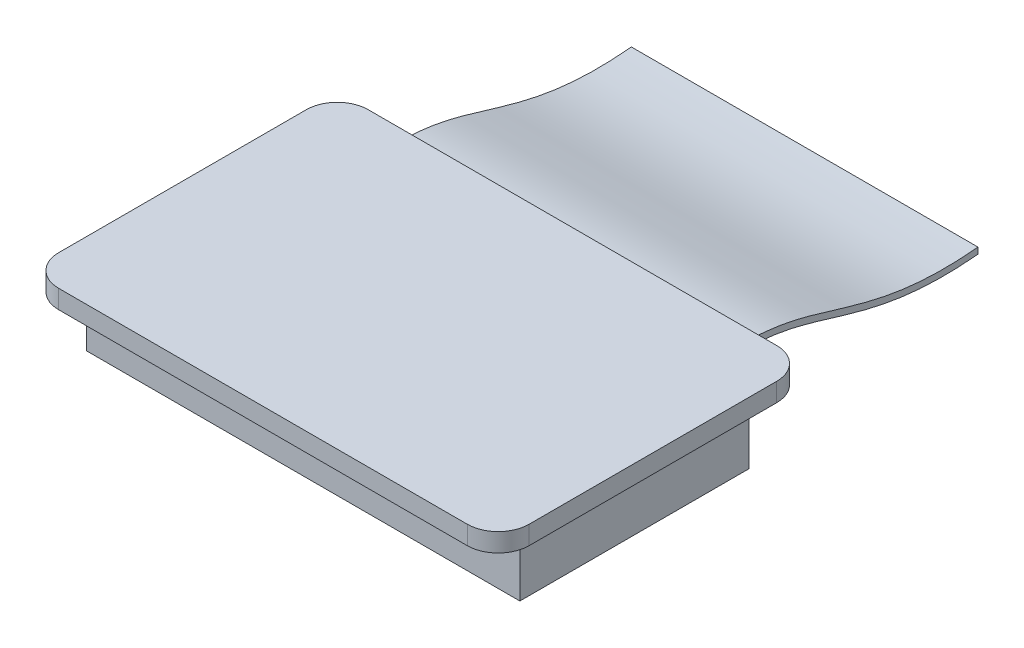
ISO-10303-21;
HEADER;
FILE_DESCRIPTION(('STEP AP214'),'2;1');
FILE_NAME('part.step','',(''),(''),'','','');
FILE_SCHEMA(('AUTOMOTIVE_DESIGN { 1 0 10303 214 1 1 1 1 }'));
ENDSEC;
DATA;
#1=APPLICATION_CONTEXT('core data for automotive mechanical design processes');
#2=APPLICATION_PROTOCOL_DEFINITION('international standard','automotive_design',2000,#1);
#3=PRODUCT_CONTEXT('',#1,'mechanical');
#4=PRODUCT('Part','Part','',(#3));
#5=PRODUCT_RELATED_PRODUCT_CATEGORY('part','',(#4));
#6=PRODUCT_DEFINITION_FORMATION('','',#4);
#7=PRODUCT_DEFINITION_CONTEXT('part definition',#1,'design');
#8=PRODUCT_DEFINITION('design','',#6,#7);
#9=PRODUCT_DEFINITION_SHAPE('','',#8);
#10=(LENGTH_UNIT() NAMED_UNIT(*) SI_UNIT(.MILLI.,.METRE.));
#11=(NAMED_UNIT(*) PLANE_ANGLE_UNIT() SI_UNIT($,.RADIAN.));
#12=(NAMED_UNIT(*) SI_UNIT($,.STERADIAN.) SOLID_ANGLE_UNIT());
#13=UNCERTAINTY_MEASURE_WITH_UNIT(LENGTH_MEASURE(1.E-05),#10,'distance_accuracy_value','');
#14=(GEOMETRIC_REPRESENTATION_CONTEXT(3) GLOBAL_UNCERTAINTY_ASSIGNED_CONTEXT((#13)) GLOBAL_UNIT_ASSIGNED_CONTEXT((#10,
#11,#12)) REPRESENTATION_CONTEXT('',''));
#15=CARTESIAN_POINT('',(0.,0.,0.));
#16=DIRECTION('',(0.,0.,1.));
#17=DIRECTION('',(1.,0.,0.));
#18=AXIS2_PLACEMENT_3D('',#15,#16,#17);
#19=CARTESIAN_POINT('',(3.3,0.748301222298696,8.25169585037883));
#20=DIRECTION('',(0.,-1.,0.));
#21=DIRECTION('',(0.,0.,-1.));
#22=AXIS2_PLACEMENT_3D('',#19,#20,#21);
#23=CYLINDRICAL_SURFACE('',#22,0.5);
#24=CARTESIAN_POINT('',(3.3,0.448301222298696,8.25169585037883));
#25=DIRECTION('',(0.,-1.,0.));
#26=DIRECTION('',(0.,0.,-1.));
#27=AXIS2_PLACEMENT_3D('',#24,#25,#26);
#28=CIRCLE('',#27,0.5);
#29=CARTESIAN_POINT('',(3.3,0.448301222298696,7.75169585037883));
#30=VERTEX_POINT('',#29);
#31=CARTESIAN_POINT('',(3.8,0.448301222298696,8.25169585037883));
#32=VERTEX_POINT('',#31);
#33=EDGE_CURVE('E177',#30,#32,#28,.T.);
#34=ORIENTED_EDGE('',*,*,#33,.F.);
#35=DIRECTION('',(0.,-1.,0.));
#36=VECTOR('',#35,1.);
#37=CARTESIAN_POINT('',(3.3,0.748301222298696,7.75169585037883));
#38=LINE('',#37,#36);
#39=CARTESIAN_POINT('',(3.3,0.748301222298696,7.75169585037883));
#40=VERTEX_POINT('',#39);
#41=EDGE_CURVE('E13',#40,#30,#38,.T.);
#42=ORIENTED_EDGE('',*,*,#41,.F.);
#43=CARTESIAN_POINT('',(3.3,0.748301222298696,8.25169585037883));
#44=DIRECTION('',(0.,-1.,0.));
#45=DIRECTION('',(0.,0.,-1.));
#46=AXIS2_PLACEMENT_3D('',#43,#44,#45);
#47=CIRCLE('',#46,0.5);
#48=CARTESIAN_POINT('',(3.8,0.748301222298696,8.25169585037883));
#49=VERTEX_POINT('',#48);
#50=EDGE_CURVE('E198',#40,#49,#47,.T.);
#51=ORIENTED_EDGE('',*,*,#50,.T.);
#52=DIRECTION('',(0.,-1.,0.));
#53=VECTOR('',#52,1.);
#54=CARTESIAN_POINT('',(3.8,0.748301222298696,8.25169585037883));
#55=LINE('',#54,#53);
#56=EDGE_CURVE('E70',#49,#32,#55,.T.);
#57=ORIENTED_EDGE('',*,*,#56,.T.);
#58=EDGE_LOOP('',(#34,#42,#51,#57));
#59=FACE_BOUND('',#58,.T.);
#60=ADVANCED_FACE('F67',(#59),#23,.T.);
#61=CARTESIAN_POINT('',(-3.3,0.748301222298696,7.75169585037883));
#62=DIRECTION('',(0.,0.,-1.));
#63=DIRECTION('',(-1.,0.,0.));
#64=AXIS2_PLACEMENT_3D('',#61,#62,#63);
#65=PLANE('',#64);
#66=DIRECTION('',(1.,0.,0.));
#67=VECTOR('',#66,1.);
#68=CARTESIAN_POINT('',(-3.3,0.448301222298696,7.75169585037883));
#69=LINE('',#68,#67);
#70=CARTESIAN_POINT('',(-3.3,0.448301222298696,7.75169585037883));
#71=VERTEX_POINT('',#70);
#72=EDGE_CURVE('E196',#71,#30,#69,.T.);
#73=ORIENTED_EDGE('',*,*,#72,.F.);
#74=DIRECTION('',(0.,-1.,0.));
#75=VECTOR('',#74,1.);
#76=CARTESIAN_POINT('',(-3.3,0.748301222298696,7.75169585037883));
#77=LINE('',#76,#75);
#78=CARTESIAN_POINT('',(-3.3,0.748301222298696,7.75169585037883));
#79=VERTEX_POINT('',#78);
#80=EDGE_CURVE('E75',#79,#71,#77,.T.);
#81=ORIENTED_EDGE('',*,*,#80,.F.);
#82=DIRECTION('',(1.,0.,0.));
#83=VECTOR('',#82,1.);
#84=CARTESIAN_POINT('',(-3.3,0.748301222298696,7.75169585037883));
#85=LINE('',#84,#83);
#86=EDGE_CURVE('E167',#79,#40,#85,.T.);
#87=ORIENTED_EDGE('',*,*,#86,.T.);
#88=ORIENTED_EDGE('',*,*,#41,.T.);
#89=EDGE_LOOP('',(#73,#81,#87,#88));
#90=FACE_BOUND('',#89,.T.);
#91=ADVANCED_FACE('F210',(#90),#65,.T.);
#92=CARTESIAN_POINT('',(-3.3,0.748301222298696,8.25169585037883));
#93=DIRECTION('',(0.,-1.,0.));
#94=DIRECTION('',(0.,0.,-1.));
#95=AXIS2_PLACEMENT_3D('',#92,#93,#94);
#96=CYLINDRICAL_SURFACE('',#95,0.5);
#97=CARTESIAN_POINT('',(-3.3,0.448301222298696,8.25169585037883));
#98=DIRECTION('',(0.,-1.,0.));
#99=DIRECTION('',(0.,0.,-1.));
#100=AXIS2_PLACEMENT_3D('',#97,#98,#99);
#101=CIRCLE('',#100,0.5);
#102=CARTESIAN_POINT('',(-3.8,0.448301222298696,8.25169585037883));
#103=VERTEX_POINT('',#102);
#104=EDGE_CURVE('E154',#103,#71,#101,.T.);
#105=ORIENTED_EDGE('',*,*,#104,.F.);
#106=DIRECTION('',(0.,-1.,0.));
#107=VECTOR('',#106,1.);
#108=CARTESIAN_POINT('',(-3.8,0.748301222298696,8.25169585037883));
#109=LINE('',#108,#107);
#110=CARTESIAN_POINT('',(-3.8,0.748301222298696,8.25169585037883));
#111=VERTEX_POINT('',#110);
#112=EDGE_CURVE('E148',#111,#103,#109,.T.);
#113=ORIENTED_EDGE('',*,*,#112,.F.);
#114=CARTESIAN_POINT('',(-3.3,0.748301222298696,8.25169585037883));
#115=DIRECTION('',(0.,-1.,0.));
#116=DIRECTION('',(0.,0.,-1.));
#117=AXIS2_PLACEMENT_3D('',#114,#115,#116);
#118=CIRCLE('',#117,0.5);
#119=EDGE_CURVE('E151',#111,#79,#118,.T.);
#120=ORIENTED_EDGE('',*,*,#119,.T.);
#121=ORIENTED_EDGE('',*,*,#80,.T.);
#122=EDGE_LOOP('',(#105,#113,#120,#121));
#123=FACE_BOUND('',#122,.T.);
#124=ADVANCED_FACE('F150',(#123),#96,.T.);
#125=CARTESIAN_POINT('',(-3.8,0.748301222298696,12.2516958503788));
#126=DIRECTION('',(-1.,0.,0.));
#127=DIRECTION('',(0.,0.,1.));
#128=AXIS2_PLACEMENT_3D('',#125,#126,#127);
#129=PLANE('',#128);
#130=DIRECTION('',(0.,0.,-1.));
#131=VECTOR('',#130,1.);
#132=CARTESIAN_POINT('',(-3.8,0.448301222298696,12.2516958503788));
#133=LINE('',#132,#131);
#134=CARTESIAN_POINT('',(-3.8,0.448301222298696,12.2516958503788));
#135=VERTEX_POINT('',#134);
#136=EDGE_CURVE('E193',#135,#103,#133,.T.);
#137=ORIENTED_EDGE('',*,*,#136,.F.);
#138=DIRECTION('',(0.,-1.,0.));
#139=VECTOR('',#138,1.);
#140=CARTESIAN_POINT('',(-3.8,0.748301222298696,12.2516958503788));
#141=LINE('',#140,#139);
#142=CARTESIAN_POINT('',(-3.8,0.748301222298696,12.2516958503788));
#143=VERTEX_POINT('',#142);
#144=EDGE_CURVE('E159',#143,#135,#141,.T.);
#145=ORIENTED_EDGE('',*,*,#144,.F.);
#146=DIRECTION('',(0.,0.,-1.));
#147=VECTOR('',#146,1.);
#148=CARTESIAN_POINT('',(-3.8,0.748301222298696,12.2516958503788));
#149=LINE('',#148,#147);
#150=EDGE_CURVE('E165',#143,#111,#149,.T.);
#151=ORIENTED_EDGE('',*,*,#150,.T.);
#152=ORIENTED_EDGE('',*,*,#112,.T.);
#153=EDGE_LOOP('',(#137,#145,#151,#152));
#154=FACE_BOUND('',#153,.T.);
#155=ADVANCED_FACE('F169',(#154),#129,.T.);
#156=CARTESIAN_POINT('',(-3.3,0.748301222298696,12.2516958503788));
#157=DIRECTION('',(0.,-1.,0.));
#158=DIRECTION('',(0.,0.,-1.));
#159=AXIS2_PLACEMENT_3D('',#156,#157,#158);
#160=CYLINDRICAL_SURFACE('',#159,0.5);
#161=CARTESIAN_POINT('',(-3.3,0.448301222298696,12.2516958503788));
#162=DIRECTION('',(0.,-1.,0.));
#163=DIRECTION('',(0.,0.,-1.));
#164=AXIS2_PLACEMENT_3D('',#161,#162,#163);
#165=CIRCLE('',#164,0.5);
#166=CARTESIAN_POINT('',(-3.3,0.448301222298696,12.7516958503788));
#167=VERTEX_POINT('',#166);
#168=EDGE_CURVE('E190',#167,#135,#165,.T.);
#169=ORIENTED_EDGE('',*,*,#168,.F.);
#170=DIRECTION('',(0.,-1.,0.));
#171=VECTOR('',#170,1.);
#172=CARTESIAN_POINT('',(-3.3,0.748301222298696,12.7516958503788));
#173=LINE('',#172,#171);
#174=CARTESIAN_POINT('',(-3.3,0.748301222298696,12.7516958503788));
#175=VERTEX_POINT('',#174);
#176=EDGE_CURVE('E202',#175,#167,#173,.T.);
#177=ORIENTED_EDGE('',*,*,#176,.F.);
#178=CARTESIAN_POINT('',(-3.3,0.748301222298696,12.2516958503788));
#179=DIRECTION('',(0.,-1.,0.));
#180=DIRECTION('',(0.,0.,-1.));
#181=AXIS2_PLACEMENT_3D('',#178,#179,#180);
#182=CIRCLE('',#181,0.5);
#183=EDGE_CURVE('E170',#175,#143,#182,.T.);
#184=ORIENTED_EDGE('',*,*,#183,.T.);
#185=ORIENTED_EDGE('',*,*,#144,.T.);
#186=EDGE_LOOP('',(#169,#177,#184,#185));
#187=FACE_BOUND('',#186,.T.);
#188=ADVANCED_FACE('F223',(#187),#160,.T.);
#189=CARTESIAN_POINT('',(-3.3,0.748301222298696,12.7516958503788));
#190=DIRECTION('',(0.,0.,1.));
#191=DIRECTION('',(1.,0.,0.));
#192=AXIS2_PLACEMENT_3D('',#189,#190,#191);
#193=PLANE('',#192);
#194=DIRECTION('',(-1.,0.,0.));
#195=VECTOR('',#194,1.);
#196=CARTESIAN_POINT('',(-3.3,0.448301222298696,12.7516958503788));
#197=LINE('',#196,#195);
#198=CARTESIAN_POINT('',(3.3,0.448301222298696,12.7516958503788));
#199=VERTEX_POINT('',#198);
#200=EDGE_CURVE('E187',#199,#167,#197,.T.);
#201=ORIENTED_EDGE('',*,*,#200,.F.);
#202=DIRECTION('',(0.,-1.,0.));
#203=VECTOR('',#202,1.);
#204=CARTESIAN_POINT('',(3.3,0.748301222298696,12.7516958503788));
#205=LINE('',#204,#203);
#206=CARTESIAN_POINT('',(3.3,0.748301222298696,12.7516958503788));
#207=VERTEX_POINT('',#206);
#208=EDGE_CURVE('E204',#207,#199,#205,.T.);
#209=ORIENTED_EDGE('',*,*,#208,.F.);
#210=DIRECTION('',(-1.,0.,0.));
#211=VECTOR('',#210,1.);
#212=CARTESIAN_POINT('',(-3.3,0.748301222298696,12.7516958503788));
#213=LINE('',#212,#211);
#214=EDGE_CURVE('E172',#207,#175,#213,.T.);
#215=ORIENTED_EDGE('',*,*,#214,.T.);
#216=ORIENTED_EDGE('',*,*,#176,.T.);
#217=EDGE_LOOP('',(#201,#209,#215,#216));
#218=FACE_BOUND('',#217,.T.);
#219=ADVANCED_FACE('F226',(#218),#193,.T.);
#220=CARTESIAN_POINT('',(3.3,0.748301222298696,12.2516958503788));
#221=DIRECTION('',(0.,-1.,0.));
#222=DIRECTION('',(0.,0.,-1.));
#223=AXIS2_PLACEMENT_3D('',#220,#221,#222);
#224=CYLINDRICAL_SURFACE('',#223,0.5);
#225=CARTESIAN_POINT('',(3.3,0.448301222298696,12.2516958503788));
#226=DIRECTION('',(0.,-1.,0.));
#227=DIRECTION('',(0.,0.,1.));
#228=AXIS2_PLACEMENT_3D('',#225,#226,#227);
#229=CIRCLE('',#228,0.5);
#230=CARTESIAN_POINT('',(3.8,0.448301222298696,12.2516958503788));
#231=VERTEX_POINT('',#230);
#232=EDGE_CURVE('E184',#231,#199,#229,.T.);
#233=ORIENTED_EDGE('',*,*,#232,.F.);
#234=DIRECTION('',(0.,-1.,0.));
#235=VECTOR('',#234,1.);
#236=CARTESIAN_POINT('',(3.8,0.748301222298696,12.2516958503788));
#237=LINE('',#236,#235);
#238=CARTESIAN_POINT('',(3.8,0.748301222298696,12.2516958503788));
#239=VERTEX_POINT('',#238);
#240=EDGE_CURVE('E205',#239,#231,#237,.T.);
#241=ORIENTED_EDGE('',*,*,#240,.F.);
#242=CARTESIAN_POINT('',(3.3,0.748301222298696,12.2516958503788));
#243=DIRECTION('',(0.,-1.,0.));
#244=DIRECTION('',(0.,0.,1.));
#245=AXIS2_PLACEMENT_3D('',#242,#243,#244);
#246=CIRCLE('',#245,0.5);
#247=EDGE_CURVE('E294',#239,#207,#246,.T.);
#248=ORIENTED_EDGE('',*,*,#247,.T.);
#249=ORIENTED_EDGE('',*,*,#208,.T.);
#250=EDGE_LOOP('',(#233,#241,#248,#249));
#251=FACE_BOUND('',#250,.T.);
#252=ADVANCED_FACE('F230',(#251),#224,.T.);
#253=CARTESIAN_POINT('',(3.8,0.748301222298696,12.2516958503788));
#254=DIRECTION('',(1.,0.,0.));
#255=DIRECTION('',(0.,0.,-1.));
#256=AXIS2_PLACEMENT_3D('',#253,#254,#255);
#257=PLANE('',#256);
#258=DIRECTION('',(0.,0.,1.));
#259=VECTOR('',#258,1.);
#260=CARTESIAN_POINT('',(3.8,0.448301222298696,12.2516958503788));
#261=LINE('',#260,#259);
#262=EDGE_CURVE('E180',#32,#231,#261,.T.);
#263=ORIENTED_EDGE('',*,*,#262,.F.);
#264=ORIENTED_EDGE('',*,*,#56,.F.);
#265=DIRECTION('',(0.,0.,1.));
#266=VECTOR('',#265,1.);
#267=CARTESIAN_POINT('',(3.8,0.748301222298696,12.2516958503788));
#268=LINE('',#267,#266);
#269=EDGE_CURVE('E292',#49,#239,#268,.T.);
#270=ORIENTED_EDGE('',*,*,#269,.T.);
#271=ORIENTED_EDGE('',*,*,#240,.T.);
#272=EDGE_LOOP('',(#263,#264,#270,#271));
#273=FACE_BOUND('',#272,.T.);
#274=ADVANCED_FACE('F207',(#273),#257,.T.);
#275=CARTESIAN_POINT('',(3.3,0.748301222298696,8.25169585037883));
#276=DIRECTION('',(0.,-1.,0.));
#277=DIRECTION('',(0.,0.,-1.));
#278=AXIS2_PLACEMENT_3D('',#275,#276,#277);
#279=PLANE('',#278);
#280=ORIENTED_EDGE('',*,*,#50,.F.);
#281=ORIENTED_EDGE('',*,*,#86,.F.);
#282=ORIENTED_EDGE('',*,*,#119,.F.);
#283=ORIENTED_EDGE('',*,*,#150,.F.);
#284=ORIENTED_EDGE('',*,*,#183,.F.);
#285=ORIENTED_EDGE('',*,*,#214,.F.);
#286=ORIENTED_EDGE('',*,*,#247,.F.);
#287=ORIENTED_EDGE('',*,*,#269,.F.);
#288=EDGE_LOOP('',(#280,#281,#282,#283,#284,#285,#286,#287));
#289=FACE_BOUND('',#288,.T.);
#290=ADVANCED_FACE('F163',(#289),#279,.F.);
#291=CARTESIAN_POINT('',(3.3,0.448301222298696,8.25169585037883));
#292=DIRECTION('',(0.,-1.,0.));
#293=DIRECTION('',(0.,0.,-1.));
#294=AXIS2_PLACEMENT_3D('',#291,#292,#293);
#295=PLANE('',#294);
#296=DIRECTION('',(0.,0.,1.));
#297=VECTOR('',#296,1.);
#298=CARTESIAN_POINT('',(3.5,0.448301222298696,12.1016958503788));
#299=LINE('',#298,#297);
#300=CARTESIAN_POINT('',(3.5,0.448301222298696,8.40169585037883));
#301=VERTEX_POINT('',#300);
#302=CARTESIAN_POINT('',(3.5,0.448301222298696,12.1016958503788));
#303=VERTEX_POINT('',#302);
#304=EDGE_CURVE('E276',#301,#303,#299,.T.);
#305=ORIENTED_EDGE('',*,*,#304,.F.);
#306=DIRECTION('',(-1.,0.,0.));
#307=VECTOR('',#306,1.);
#308=CARTESIAN_POINT('',(3.5,0.448301222298696,8.40169585037883));
#309=LINE('',#308,#307);
#310=CARTESIAN_POINT('',(-3.5,0.448301222298696,8.40169585037883));
#311=VERTEX_POINT('',#310);
#312=EDGE_CURVE('E287',#301,#311,#309,.T.);
#313=ORIENTED_EDGE('',*,*,#312,.T.);
#314=DIRECTION('',(0.,0.,1.));
#315=VECTOR('',#314,1.);
#316=CARTESIAN_POINT('',(-3.5,0.448301222298696,12.1016958503788));
#317=LINE('',#316,#315);
#318=CARTESIAN_POINT('',(-3.5,0.448301222298696,12.1016958503788));
#319=VERTEX_POINT('',#318);
#320=EDGE_CURVE('E279',#311,#319,#317,.T.);
#321=ORIENTED_EDGE('',*,*,#320,.T.);
#322=DIRECTION('',(-1.,0.,0.));
#323=VECTOR('',#322,1.);
#324=CARTESIAN_POINT('',(3.5,0.448301222298696,12.1016958503788));
#325=LINE('',#324,#323);
#326=EDGE_CURVE('E303',#303,#319,#325,.T.);
#327=ORIENTED_EDGE('',*,*,#326,.F.);
#328=EDGE_LOOP('',(#305,#313,#321,#327));
#329=FACE_BOUND('',#328,.T.);
#330=ORIENTED_EDGE('',*,*,#33,.T.);
#331=ORIENTED_EDGE('',*,*,#262,.T.);
#332=ORIENTED_EDGE('',*,*,#232,.T.);
#333=ORIENTED_EDGE('',*,*,#200,.T.);
#334=ORIENTED_EDGE('',*,*,#168,.T.);
#335=ORIENTED_EDGE('',*,*,#136,.T.);
#336=ORIENTED_EDGE('',*,*,#104,.T.);
#337=ORIENTED_EDGE('',*,*,#72,.T.);
#338=EDGE_LOOP('',(#330,#331,#332,#333,#334,#335,#336,#337));
#339=FACE_BOUND('',#338,.T.);
#340=ADVANCED_FACE('F209',(#329,#339),#295,.T.);
#341=CARTESIAN_POINT('',(3.5,0.448301222298696,12.1016958503788));
#342=DIRECTION('',(0.,0.,-1.));
#343=DIRECTION('',(-1.,0.,0.));
#344=AXIS2_PLACEMENT_3D('',#341,#342,#343);
#345=PLANE('',#344);
#346=DIRECTION('',(0.,-1.,0.));
#347=VECTOR('',#346,1.);
#348=CARTESIAN_POINT('',(-3.5,0.448301222298696,12.1016958503788));
#349=LINE('',#348,#347);
#350=CARTESIAN_POINT('',(-3.5,-0.551698777701304,12.1016958503788));
#351=VERTEX_POINT('',#350);
#352=EDGE_CURVE('E83',#319,#351,#349,.T.);
#353=ORIENTED_EDGE('',*,*,#352,.T.);
#354=DIRECTION('',(-1.,0.,0.));
#355=VECTOR('',#354,1.);
#356=CARTESIAN_POINT('',(3.5,-0.551698777701304,12.1016958503788));
#357=LINE('',#356,#355);
#358=CARTESIAN_POINT('',(3.5,-0.551698777701304,12.1016958503788));
#359=VERTEX_POINT('',#358);
#360=EDGE_CURVE('E181',#359,#351,#357,.T.);
#361=ORIENTED_EDGE('',*,*,#360,.F.);
#362=DIRECTION('',(0.,-1.,0.));
#363=VECTOR('',#362,1.);
#364=CARTESIAN_POINT('',(3.5,0.448301222298696,12.1016958503788));
#365=LINE('',#364,#363);
#366=EDGE_CURVE('E268',#303,#359,#365,.T.);
#367=ORIENTED_EDGE('',*,*,#366,.F.);
#368=ORIENTED_EDGE('',*,*,#326,.T.);
#369=EDGE_LOOP('',(#353,#361,#367,#368));
#370=FACE_BOUND('',#369,.T.);
#371=ADVANCED_FACE('F241',(#370),#345,.F.);
#372=CARTESIAN_POINT('',(3.5,-0.551698777701304,12.1016958503788));
#373=DIRECTION('',(0.,1.,0.));
#374=DIRECTION('',(0.,0.,1.));
#375=AXIS2_PLACEMENT_3D('',#372,#373,#374);
#376=PLANE('',#375);
#377=DIRECTION('',(0.,0.,-1.));
#378=VECTOR('',#377,1.);
#379=CARTESIAN_POINT('',(-3.5,-0.551698777701304,12.1016958503788));
#380=LINE('',#379,#378);
#381=CARTESIAN_POINT('',(-3.5,-0.551698777701304,8.40169585037883));
#382=VERTEX_POINT('',#381);
#383=EDGE_CURVE('E310',#351,#382,#380,.T.);
#384=ORIENTED_EDGE('',*,*,#383,.T.);
#385=DIRECTION('',(-1.,0.,0.));
#386=VECTOR('',#385,1.);
#387=CARTESIAN_POINT('',(3.5,-0.551698777701304,8.40169585037883));
#388=LINE('',#387,#386);
#389=CARTESIAN_POINT('',(3.5,-0.551698777701304,8.40169585037883));
#390=VERTEX_POINT('',#389);
#391=EDGE_CURVE('E284',#390,#382,#388,.T.);
#392=ORIENTED_EDGE('',*,*,#391,.F.);
#393=DIRECTION('',(0.,0.,-1.));
#394=VECTOR('',#393,1.);
#395=CARTESIAN_POINT('',(3.5,-0.551698777701304,12.1016958503788));
#396=LINE('',#395,#394);
#397=EDGE_CURVE('E273',#359,#390,#396,.T.);
#398=ORIENTED_EDGE('',*,*,#397,.F.);
#399=ORIENTED_EDGE('',*,*,#360,.T.);
#400=EDGE_LOOP('',(#384,#392,#398,#399));
#401=FACE_BOUND('',#400,.T.);
#402=ADVANCED_FACE('F246',(#401),#376,.F.);
#403=CARTESIAN_POINT('',(3.5,0.448301222298696,8.40169585037883));
#404=DIRECTION('',(0.,0.,1.));
#405=DIRECTION('',(1.,0.,0.));
#406=AXIS2_PLACEMENT_3D('',#403,#404,#405);
#407=PLANE('',#406);
#408=DIRECTION('',(0.,1.,0.));
#409=VECTOR('',#408,1.);
#410=CARTESIAN_POINT('',(-3.5,0.448301222298696,8.40169585037883));
#411=LINE('',#410,#409);
#412=EDGE_CURVE('E307',#382,#311,#411,.T.);
#413=ORIENTED_EDGE('',*,*,#412,.T.);
#414=ORIENTED_EDGE('',*,*,#312,.F.);
#415=DIRECTION('',(0.,1.,0.));
#416=VECTOR('',#415,1.);
#417=CARTESIAN_POINT('',(3.5,0.448301222298696,8.40169585037883));
#418=LINE('',#417,#416);
#419=EDGE_CURVE('E314',#390,#301,#418,.T.);
#420=ORIENTED_EDGE('',*,*,#419,.F.);
#421=ORIENTED_EDGE('',*,*,#391,.T.);
#422=EDGE_LOOP('',(#413,#414,#420,#421));
#423=FACE_BOUND('',#422,.T.);
#424=ADVANCED_FACE('F250',(#423),#407,.F.);
#425=CARTESIAN_POINT('',(3.5,0.,0.));
#426=DIRECTION('',(1.,0.,0.));
#427=DIRECTION('',(0.,0.,-1.));
#428=AXIS2_PLACEMENT_3D('',#425,#426,#427);
#429=PLANE('',#428);
#430=ORIENTED_EDGE('',*,*,#366,.T.);
#431=ORIENTED_EDGE('',*,*,#397,.T.);
#432=ORIENTED_EDGE('',*,*,#419,.T.);
#433=ORIENTED_EDGE('',*,*,#304,.T.);
#434=EDGE_LOOP('',(#430,#431,#432,#433));
#435=FACE_BOUND('',#434,.T.);
#436=ADVANCED_FACE('F254',(#435),#429,.T.);
#437=CARTESIAN_POINT('',(-3.5,0.,0.));
#438=DIRECTION('',(1.,0.,0.));
#439=DIRECTION('',(0.,0.,-1.));
#440=AXIS2_PLACEMENT_3D('',#437,#438,#439);
#441=PLANE('',#440);
#442=ORIENTED_EDGE('',*,*,#352,.F.);
#443=ORIENTED_EDGE('',*,*,#320,.F.);
#444=ORIENTED_EDGE('',*,*,#412,.F.);
#445=ORIENTED_EDGE('',*,*,#383,.F.);
#446=EDGE_LOOP('',(#442,#443,#444,#445));
#447=FACE_BOUND('',#446,.T.);
#448=ADVANCED_FACE('F256',(#447),#441,.F.);
#449=CLOSED_SHELL('',(#60,#91,#124,#155,#188,#219,#252,#274,#290,#340,#371,#402,#424,#436,#448));
#450=MANIFOLD_SOLID_BREP('B2',#449);
#451=CARTESIAN_POINT('',(0.,0.547843022465262,7.74213394577779));
#452=DIRECTION('',(0.,0.0956190460103406,0.995418001665668));
#453=DIRECTION('',(1.,0.,0.));
#454=AXIS2_PLACEMENT_3D('',#451,#452,#453);
#455=PLANE('',#454);
#456=DIRECTION('',(0.,-0.995418001665668,0.0956190460103406));
#457=VECTOR('',#456,1.);
#458=CARTESIAN_POINT('',(-2.8,0.547843022465262,7.74213394577779));
#459=LINE('',#458,#457);
#460=CARTESIAN_POINT('',(-2.8,0.547843022465262,7.74213394577779));
#461=VERTEX_POINT('',#460);
#462=CARTESIAN_POINT('',(-2.8,0.448301222298696,7.75169585037883));
#463=VERTEX_POINT('',#462);
#464=EDGE_CURVE('E470',#461,#463,#459,.T.);
#465=ORIENTED_EDGE('',*,*,#464,.T.);
#466=DIRECTION('',(1.,0.,0.));
#467=VECTOR('',#466,1.);
#468=CARTESIAN_POINT('',(-2.8,0.448301222298696,7.75169585037883));
#469=LINE('',#468,#467);
#470=CARTESIAN_POINT('',(2.8,0.448301222298696,7.75169585037883));
#471=VERTEX_POINT('',#470);
#472=EDGE_CURVE('E476',#463,#471,#469,.T.);
#473=ORIENTED_EDGE('',*,*,#472,.T.);
#474=DIRECTION('',(0.,0.995418001665668,-0.0956190460103406));
#475=VECTOR('',#474,1.);
#476=CARTESIAN_POINT('',(2.8,0.547843022465263,7.74213394577779));
#477=LINE('',#476,#475);
#478=CARTESIAN_POINT('',(2.8,0.547843022465263,7.74213394577779));
#479=VERTEX_POINT('',#478);
#480=EDGE_CURVE('E471',#471,#479,#477,.T.);
#481=ORIENTED_EDGE('',*,*,#480,.T.);
#482=DIRECTION('',(-1.,0.,0.));
#483=VECTOR('',#482,1.);
#484=CARTESIAN_POINT('',(-2.8,0.547843022465262,7.74213394577779));
#485=LINE('',#484,#483);
#486=EDGE_CURVE('E431',#479,#461,#485,.T.);
#487=ORIENTED_EDGE('',*,*,#486,.T.);
#488=EDGE_LOOP('',(#465,#473,#481,#487));
#489=FACE_BOUND('',#488,.T.);
#490=ADVANCED_FACE('F427',(#489),#455,.T.);
#491=CARTESIAN_POINT('',(0.,0.,3.99999999999998));
#492=DIRECTION('',(0.,0.,1.));
#493=DIRECTION('',(1.,0.,0.));
#494=AXIS2_PLACEMENT_3D('',#491,#492,#493);
#495=PLANE('',#494);
#496=DIRECTION('',(0.,-1.,0.));
#497=VECTOR('',#496,1.);
#498=CARTESIAN_POINT('',(-2.8,0.,3.99999999999998));
#499=LINE('',#498,#497);
#500=CARTESIAN_POINT('',(-2.8,0.,3.99999999999998));
#501=VERTEX_POINT('',#500);
#502=CARTESIAN_POINT('',(-2.8,-0.0999999999999998,3.99999999999998));
#503=VERTEX_POINT('',#502);
#504=EDGE_CURVE('E480',#501,#503,#499,.T.);
#505=ORIENTED_EDGE('',*,*,#504,.F.);
#506=DIRECTION('',(-1.,0.,0.));
#507=VECTOR('',#506,1.);
#508=CARTESIAN_POINT('',(-2.8,0.,3.99999999999998));
#509=LINE('',#508,#507);
#510=CARTESIAN_POINT('',(2.8,0.,3.99999999999998));
#511=VERTEX_POINT('',#510);
#512=EDGE_CURVE('E65',#511,#501,#509,.T.);
#513=ORIENTED_EDGE('',*,*,#512,.F.);
#514=DIRECTION('',(0.,1.,0.));
#515=VECTOR('',#514,1.);
#516=CARTESIAN_POINT('',(2.8,0.,3.99999999999998));
#517=LINE('',#516,#515);
#518=CARTESIAN_POINT('',(2.8,-0.0999999999999998,3.99999999999998));
#519=VERTEX_POINT('',#518);
#520=EDGE_CURVE('E437',#519,#511,#517,.T.);
#521=ORIENTED_EDGE('',*,*,#520,.F.);
#522=DIRECTION('',(1.,0.,0.));
#523=VECTOR('',#522,1.);
#524=CARTESIAN_POINT('',(-2.8,-0.0999999999999998,3.99999999999998));
#525=LINE('',#524,#523);
#526=EDGE_CURVE('E482',#503,#519,#525,.T.);
#527=ORIENTED_EDGE('',*,*,#526,.F.);
#528=EDGE_LOOP('',(#505,#513,#521,#527));
#529=FACE_BOUND('',#528,.T.);
#530=ADVANCED_FACE('F520',(#529),#495,.F.);
#531=CARTESIAN_POINT('',(2.8,0.,3.99999999999998));
#532=CARTESIAN_POINT('',(2.8,-0.024628468128532,4.25638846601688));
#533=CARTESIAN_POINT('',(2.8,-0.0386180157529813,4.72259081002346));
#534=CARTESIAN_POINT('',(2.8,0.0194715301087126,5.3120111853385));
#535=CARTESIAN_POINT('',(2.8,0.129906644668738,5.82138904334296));
#536=CARTESIAN_POINT('',(2.8,0.291873769263778,6.3680270958267));
#537=CARTESIAN_POINT('',(2.8,0.477782991355757,6.96597559310496));
#538=CARTESIAN_POINT('',(2.8,0.547843022465264,7.46326880544397));
#539=CARTESIAN_POINT('',(2.8,0.547843022465264,7.74213394577779));
#540=CARTESIAN_POINT('',(-2.8,0.,3.99999999999998));
#541=CARTESIAN_POINT('',(-2.8,-0.0246284681285331,4.25638846601688));
#542=CARTESIAN_POINT('',(-2.8,-0.0386180157529824,4.72259081002346));
#543=CARTESIAN_POINT('',(-2.8,0.0194715301087115,5.3120111853385));
#544=CARTESIAN_POINT('',(-2.8,0.129906644668737,5.82138904334296));
#545=CARTESIAN_POINT('',(-2.8,0.291873769263777,6.3680270958267));
#546=CARTESIAN_POINT('',(-2.8,0.477782991355756,6.96597559310497));
#547=CARTESIAN_POINT('',(-2.8,0.547843022465263,7.46326880544397));
#548=CARTESIAN_POINT('',(-2.8,0.547843022465263,7.74213394577779));
#549=B_SPLINE_SURFACE_WITH_KNOTS('',1,3,((#531,#532,#533,#534,#535,#536,#537,#538,#539),(#540,
#541,#542,#543,#544,#545,#546,#547,#548)),.UNSPECIFIED.,.F.,.F.,.F.,(2,2),(4,1,1,1,1,1,4),
(0.508771929824561,1.),(0.,0.14,0.28,0.42,0.559999999997895,0.780000000000162,1.),.UNSPECIFIED.);
#550=CARTESIAN_POINT('',(-2.8,0.,3.99999999999998));
#551=CARTESIAN_POINT('',(-2.8,-0.0246284681285331,4.25638846601688));
#552=CARTESIAN_POINT('',(-2.8,-0.0386180157529824,4.72259081002346));
#553=CARTESIAN_POINT('',(-2.8,0.0194715301087115,5.3120111853385));
#554=CARTESIAN_POINT('',(-2.8,0.129906644668737,5.82138904334296));
#555=CARTESIAN_POINT('',(-2.8,0.291873769263777,6.3680270958267));
#556=CARTESIAN_POINT('',(-2.8,0.477782991355756,6.96597559310497));
#557=CARTESIAN_POINT('',(-2.8,0.547843022465263,7.46326880544397));
#558=CARTESIAN_POINT('',(-2.8,0.547843022465263,7.74213394577779));
#559=B_SPLINE_CURVE_WITH_KNOTS('',3,(#550,#551,#552,#553,#554,#555,#556,#557,#558),
.UNSPECIFIED.,.F.,.F.,(4,1,1,1,1,1,4),(0.,0.14,0.28,0.42,0.559999999997895,0.780000000000162,
1.),.UNSPECIFIED.);
#560=EDGE_CURVE('E446',#501,#461,#559,.T.);
#561=CARTESIAN_POINT('',(2.8,0.,3.99999999999998));
#562=CARTESIAN_POINT('',(2.8,-0.024628468128532,4.25638846601688));
#563=CARTESIAN_POINT('',(2.8,-0.0386180157529813,4.72259081002346));
#564=CARTESIAN_POINT('',(2.8,0.0194715301087126,5.3120111853385));
#565=CARTESIAN_POINT('',(2.8,0.129906644668738,5.82138904334296));
#566=CARTESIAN_POINT('',(2.8,0.291873769263778,6.3680270958267));
#567=CARTESIAN_POINT('',(2.8,0.477782991355757,6.96597559310496));
#568=CARTESIAN_POINT('',(2.8,0.547843022465264,7.46326880544397));
#569=CARTESIAN_POINT('',(2.8,0.547843022465264,7.74213394577779));
#570=B_SPLINE_CURVE_WITH_KNOTS('',3,(#561,#562,#563,#564,#565,#566,#567,#568,#569),
.UNSPECIFIED.,.F.,.F.,(4,1,1,1,1,1,4),(0.,0.14,0.28,0.42,0.559999999997895,0.780000000000162,
1.),.UNSPECIFIED.);
#571=EDGE_CURVE('E463',#511,#479,#570,.T.);
#572=ORIENTED_EDGE('',*,*,#512,.T.);
#573=ORIENTED_EDGE('',*,*,#560,.T.);
#574=ORIENTED_EDGE('',*,*,#486,.F.);
#575=ORIENTED_EDGE('',*,*,#571,.F.);
#576=EDGE_LOOP('',(#572,#573,#574,#575));
#577=FACE_BOUND('',#576,.T.);
#578=ADVANCED_FACE('F478',(#577),#549,.T.);
#579=CARTESIAN_POINT('',(2.8,-0.0999999999999998,3.99999999999998));
#580=DIRECTION('',(1.,0.,0.));
#581=DIRECTION('',(0.,1.,0.));
#582=AXIS2_PLACEMENT_3D('',#579,#580,#581);
#583=PLANE('',#582);
#584=ORIENTED_EDGE('',*,*,#520,.T.);
#585=ORIENTED_EDGE('',*,*,#571,.T.);
#586=ORIENTED_EDGE('',*,*,#480,.F.);
#587=CARTESIAN_POINT('',(2.8,-0.0999999999999998,3.99999999999998));
#588=CARTESIAN_POINT('',(2.8,-0.124487822602086,4.2605128606233));
#589=CARTESIAN_POINT('',(2.8,-0.13819607917364,4.73496399384273));
#590=CARTESIAN_POINT('',(2.8,-0.0775684463145837,5.33705516657012));
#591=CARTESIAN_POINT('',(2.8,0.0359942616894103,5.85609097163903));
#592=CARTESIAN_POINT('',(2.8,0.200282397231649,6.40790162664091));
#593=CARTESIAN_POINT('',(2.8,0.38279321622902,6.99976726735009));
#594=CARTESIAN_POINT('',(2.8,0.449818563978634,7.48090729992634));
#595=CARTESIAN_POINT('',(2.8,0.448301222298696,7.75169585037883));
#596=B_SPLINE_CURVE_WITH_KNOTS('',3,(#587,#588,#589,#590,#591,#592,#593,#594,#595),
.UNSPECIFIED.,.F.,.F.,(4,1,1,1,1,1,4),(0.,0.14,0.28,0.42,0.559999999997895,0.780000000000162,
1.),.UNSPECIFIED.);
#597=EDGE_CURVE('E484',#519,#471,#596,.T.);
#598=ORIENTED_EDGE('',*,*,#597,.F.);
#599=EDGE_LOOP('',(#584,#585,#586,#598));
#600=FACE_BOUND('',#599,.T.);
#601=ADVANCED_FACE('F516',(#600),#583,.T.);
#602=CARTESIAN_POINT('',(-2.8,-0.0999999999999998,3.99999999999998));
#603=CARTESIAN_POINT('',(-2.8,-0.124487822602086,4.2605128606233));
#604=CARTESIAN_POINT('',(-2.8,-0.13819607917364,4.73496399384273));
#605=CARTESIAN_POINT('',(-2.8,-0.0775684463145837,5.33705516657012));
#606=CARTESIAN_POINT('',(-2.8,0.0359942616894103,5.85609097163903));
#607=CARTESIAN_POINT('',(-2.8,0.200282397231649,6.40790162664091));
#608=CARTESIAN_POINT('',(-2.8,0.38279321622902,6.99976726735009));
#609=CARTESIAN_POINT('',(-2.8,0.449818563978634,7.48090729992634));
#610=CARTESIAN_POINT('',(-2.8,0.448301222298696,7.75169585037883));
#611=CARTESIAN_POINT('',(2.8,-0.0999999999999998,3.99999999999998));
#612=CARTESIAN_POINT('',(2.8,-0.124487822602086,4.2605128606233));
#613=CARTESIAN_POINT('',(2.8,-0.13819607917364,4.73496399384273));
#614=CARTESIAN_POINT('',(2.8,-0.0775684463145837,5.33705516657012));
#615=CARTESIAN_POINT('',(2.8,0.0359942616894103,5.85609097163903));
#616=CARTESIAN_POINT('',(2.8,0.200282397231649,6.40790162664091));
#617=CARTESIAN_POINT('',(2.8,0.38279321622902,6.99976726735009));
#618=CARTESIAN_POINT('',(2.8,0.449818563978634,7.48090729992634));
#619=CARTESIAN_POINT('',(2.8,0.448301222298696,7.75169585037883));
#620=B_SPLINE_SURFACE_WITH_KNOTS('',1,3,((#602,#603,#604,#605,#606,#607,#608,#609,#610),(#611,
#612,#613,#614,#615,#616,#617,#618,#619)),.UNSPECIFIED.,.F.,.F.,.F.,(2,2),(4,1,1,1,1,1,4),
(0.00877192982456138,0.5),(0.,0.14,0.28,0.42,0.559999999997895,0.780000000000162,1.),.UNSPECIFIED.);
#621=CARTESIAN_POINT('',(-2.8,-0.0999999999999998,3.99999999999998));
#622=CARTESIAN_POINT('',(-2.8,-0.124487822602086,4.2605128606233));
#623=CARTESIAN_POINT('',(-2.8,-0.13819607917364,4.73496399384273));
#624=CARTESIAN_POINT('',(-2.8,-0.0775684463145837,5.33705516657012));
#625=CARTESIAN_POINT('',(-2.8,0.0359942616894103,5.85609097163903));
#626=CARTESIAN_POINT('',(-2.8,0.200282397231649,6.40790162664091));
#627=CARTESIAN_POINT('',(-2.8,0.38279321622902,6.99976726735009));
#628=CARTESIAN_POINT('',(-2.8,0.449818563978634,7.48090729992634));
#629=CARTESIAN_POINT('',(-2.8,0.448301222298696,7.75169585037883));
#630=B_SPLINE_CURVE_WITH_KNOTS('',3,(#621,#622,#623,#624,#625,#626,#627,#628,#629),
.UNSPECIFIED.,.F.,.F.,(4,1,1,1,1,1,4),(0.,0.14,0.28,0.42,0.559999999997895,0.780000000000162,
1.),.UNSPECIFIED.);
#631=EDGE_CURVE('E473',#503,#463,#630,.T.);
#632=ORIENTED_EDGE('',*,*,#526,.T.);
#633=ORIENTED_EDGE('',*,*,#597,.T.);
#634=ORIENTED_EDGE('',*,*,#472,.F.);
#635=ORIENTED_EDGE('',*,*,#631,.F.);
#636=EDGE_LOOP('',(#632,#633,#634,#635));
#637=FACE_BOUND('',#636,.T.);
#638=ADVANCED_FACE('F513',(#637),#620,.T.);
#639=CARTESIAN_POINT('',(-2.8,0.,3.99999999999998));
#640=DIRECTION('',(-1.,0.,0.));
#641=DIRECTION('',(0.,-1.,0.));
#642=AXIS2_PLACEMENT_3D('',#639,#640,#641);
#643=PLANE('',#642);
#644=ORIENTED_EDGE('',*,*,#504,.T.);
#645=ORIENTED_EDGE('',*,*,#631,.T.);
#646=ORIENTED_EDGE('',*,*,#464,.F.);
#647=ORIENTED_EDGE('',*,*,#560,.F.);
#648=EDGE_LOOP('',(#644,#645,#646,#647));
#649=FACE_BOUND('',#648,.T.);
#650=ADVANCED_FACE('F429',(#649),#643,.T.);
#651=CLOSED_SHELL('',(#490,#530,#578,#601,#638,#650));
#652=MANIFOLD_SOLID_BREP('B7',#651);
#653=ADVANCED_BREP_SHAPE_REPRESENTATION('',(#18,#450,#652),#14);
#654=SHAPE_DEFINITION_REPRESENTATION(#9,#653);
ENDSEC;
END-ISO-10303-21;
